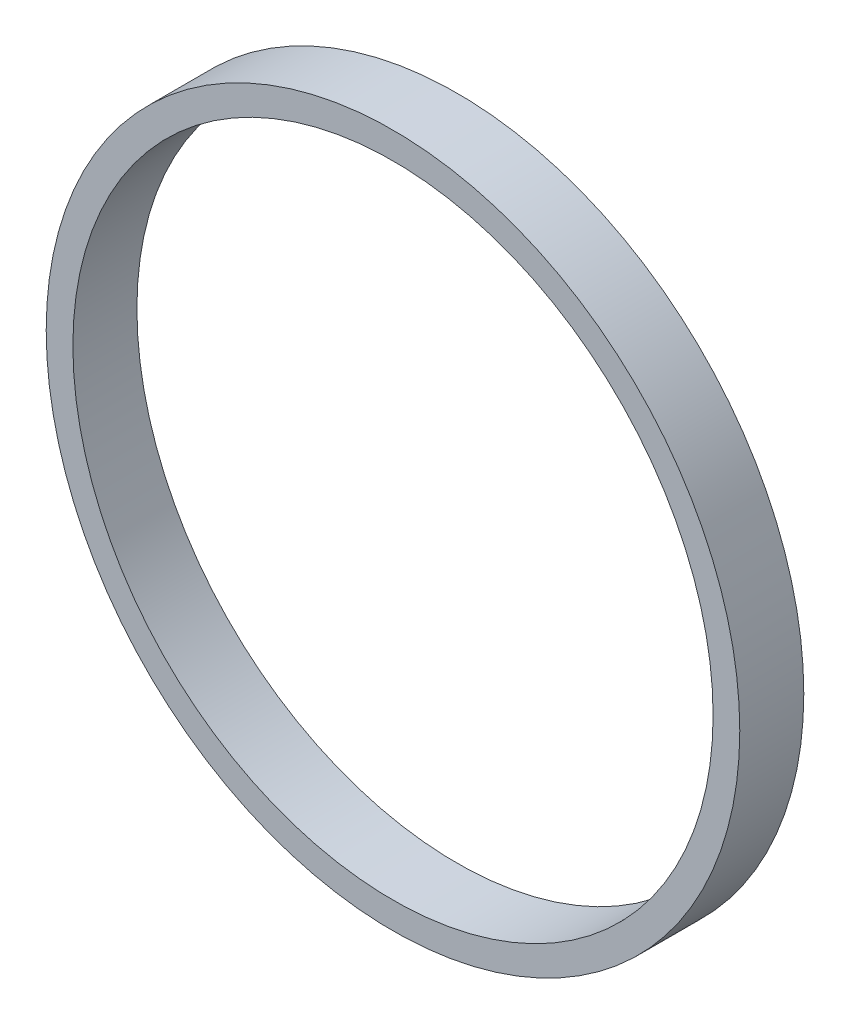
ISO-10303-21;
HEADER;
FILE_DESCRIPTION(('STEP AP214'),'2;1');
FILE_NAME('part.step','',(''),(''),'','','');
FILE_SCHEMA(('AUTOMOTIVE_DESIGN { 1 0 10303 214 1 1 1 1 }'));
ENDSEC;
DATA;
#1=APPLICATION_CONTEXT('core data for automotive mechanical design processes');
#2=APPLICATION_PROTOCOL_DEFINITION('international standard','automotive_design',2000,#1);
#3=PRODUCT_CONTEXT('',#1,'mechanical');
#4=PRODUCT('Part','Part','',(#3));
#5=PRODUCT_RELATED_PRODUCT_CATEGORY('part','',(#4));
#6=PRODUCT_DEFINITION_FORMATION('','',#4);
#7=PRODUCT_DEFINITION_CONTEXT('part definition',#1,'design');
#8=PRODUCT_DEFINITION('design','',#6,#7);
#9=PRODUCT_DEFINITION_SHAPE('','',#8);
#10=(LENGTH_UNIT() NAMED_UNIT(*) SI_UNIT(.MILLI.,.METRE.));
#11=(NAMED_UNIT(*) PLANE_ANGLE_UNIT() SI_UNIT($,.RADIAN.));
#12=(NAMED_UNIT(*) SI_UNIT($,.STERADIAN.) SOLID_ANGLE_UNIT());
#13=UNCERTAINTY_MEASURE_WITH_UNIT(LENGTH_MEASURE(1.E-05),#10,'distance_accuracy_value','');
#14=(GEOMETRIC_REPRESENTATION_CONTEXT(3) GLOBAL_UNCERTAINTY_ASSIGNED_CONTEXT((#13)) GLOBAL_UNIT_ASSIGNED_CONTEXT((#10,
#11,#12)) REPRESENTATION_CONTEXT('',''));
#15=CARTESIAN_POINT('',(0.,0.,0.));
#16=DIRECTION('',(0.,0.,1.));
#17=DIRECTION('',(1.,0.,0.));
#18=AXIS2_PLACEMENT_3D('',#15,#16,#17);
#19=CARTESIAN_POINT('',(0.,0.,3.));
#20=DIRECTION('',(0.,0.,1.));
#21=DIRECTION('',(1.,0.,0.));
#22=AXIS2_PLACEMENT_3D('',#19,#20,#21);
#23=PLANE('',#22);
#24=CARTESIAN_POINT('',(0.,0.,3.));
#25=DIRECTION('',(0.,0.,1.));
#26=DIRECTION('',(1.,0.,0.));
#27=AXIS2_PLACEMENT_3D('',#24,#25,#26);
#28=CIRCLE('',#27,32.5);
#29=CARTESIAN_POINT('',(32.5,0.,3.));
#30=VERTEX_POINT('',#29);
#31=EDGE_CURVE('E10',#30,#30,#28,.T.);
#32=ORIENTED_EDGE('',*,*,#31,.T.);
#33=EDGE_LOOP('',(#32));
#34=FACE_BOUND('',#33,.T.);
#35=CARTESIAN_POINT('',(0.,0.,3.));
#36=DIRECTION('',(0.,0.,1.));
#37=DIRECTION('',(1.,0.,0.));
#38=AXIS2_PLACEMENT_3D('',#35,#36,#37);
#39=CIRCLE('',#38,30.);
#40=CARTESIAN_POINT('',(30.,0.,3.));
#41=VERTEX_POINT('',#40);
#42=EDGE_CURVE('E42',#41,#41,#39,.T.);
#43=ORIENTED_EDGE('',*,*,#42,.F.);
#44=EDGE_LOOP('',(#43));
#45=FACE_BOUND('',#44,.T.);
#46=ADVANCED_FACE('F31',(#34,#45),#23,.T.);
#47=CARTESIAN_POINT('',(0.,0.,-3.));
#48=DIRECTION('',(0.,0.,1.));
#49=DIRECTION('',(1.,0.,0.));
#50=AXIS2_PLACEMENT_3D('',#47,#48,#49);
#51=PLANE('',#50);
#52=CARTESIAN_POINT('',(0.,0.,-3.));
#53=DIRECTION('',(0.,0.,1.));
#54=DIRECTION('',(1.,0.,0.));
#55=AXIS2_PLACEMENT_3D('',#52,#53,#54);
#56=CIRCLE('',#55,32.5);
#57=CARTESIAN_POINT('',(32.5,0.,-3.));
#58=VERTEX_POINT('',#57);
#59=EDGE_CURVE('E35',#58,#58,#56,.T.);
#60=ORIENTED_EDGE('',*,*,#59,.F.);
#61=EDGE_LOOP('',(#60));
#62=FACE_BOUND('',#61,.T.);
#63=CARTESIAN_POINT('',(0.,0.,-3.));
#64=DIRECTION('',(0.,0.,1.));
#65=DIRECTION('',(1.,0.,0.));
#66=AXIS2_PLACEMENT_3D('',#63,#64,#65);
#67=CIRCLE('',#66,30.);
#68=CARTESIAN_POINT('',(30.,0.,-3.));
#69=VERTEX_POINT('',#68);
#70=EDGE_CURVE('E44',#69,#69,#67,.T.);
#71=ORIENTED_EDGE('',*,*,#70,.T.);
#72=EDGE_LOOP('',(#71));
#73=FACE_BOUND('',#72,.T.);
#74=ADVANCED_FACE('F54',(#62,#73),#51,.F.);
#75=CARTESIAN_POINT('',(0.,0.,3.));
#76=DIRECTION('',(0.,0.,-1.));
#77=DIRECTION('',(-1.,0.,0.));
#78=AXIS2_PLACEMENT_3D('',#75,#76,#77);
#79=CYLINDRICAL_SURFACE('',#78,32.5);
#80=ORIENTED_EDGE('',*,*,#31,.F.);
#81=EDGE_LOOP('',(#80));
#82=FACE_BOUND('',#81,.T.);
#83=ORIENTED_EDGE('',*,*,#59,.T.);
#84=EDGE_LOOP('',(#83));
#85=FACE_BOUND('',#84,.T.);
#86=ADVANCED_FACE('F33',(#82,#85),#79,.T.);
#87=CARTESIAN_POINT('',(0.,0.,3.));
#88=DIRECTION('',(0.,0.,-1.));
#89=DIRECTION('',(-1.,0.,0.));
#90=AXIS2_PLACEMENT_3D('',#87,#88,#89);
#91=CYLINDRICAL_SURFACE('',#90,30.);
#92=ORIENTED_EDGE('',*,*,#42,.T.);
#93=EDGE_LOOP('',(#92));
#94=FACE_BOUND('',#93,.T.);
#95=ORIENTED_EDGE('',*,*,#70,.F.);
#96=EDGE_LOOP('',(#95));
#97=FACE_BOUND('',#96,.T.);
#98=ADVANCED_FACE('F50',(#94,#97),#91,.F.);
#99=CLOSED_SHELL('',(#46,#74,#86,#98));
#100=MANIFOLD_SOLID_BREP('B2',#99);
#101=ADVANCED_BREP_SHAPE_REPRESENTATION('',(#18,#100),#14);
#102=SHAPE_DEFINITION_REPRESENTATION(#9,#101);
ENDSEC;
END-ISO-10303-21;
